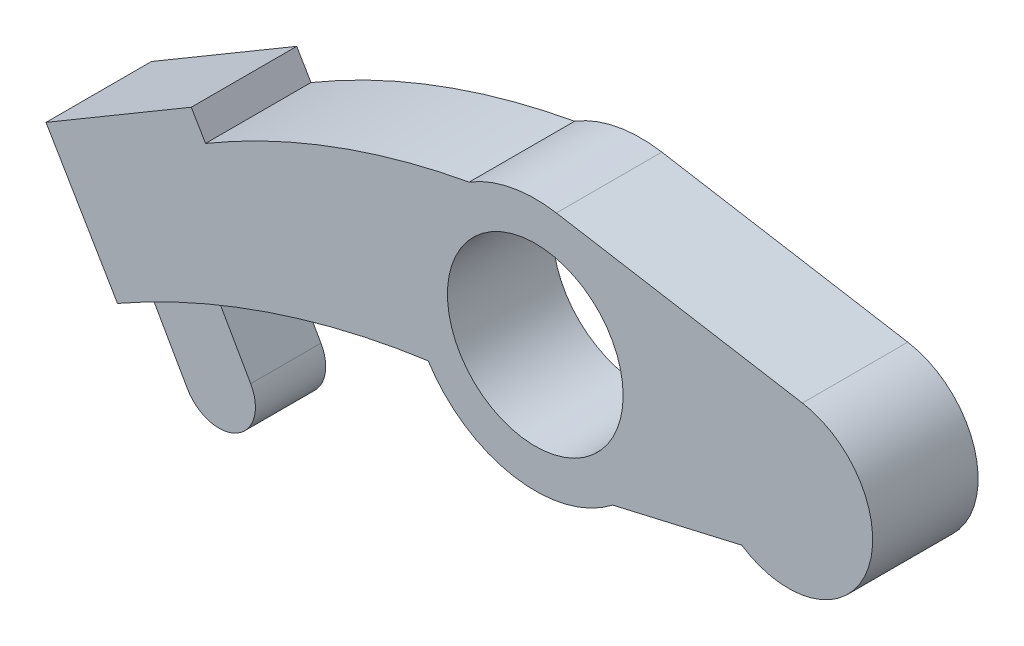
ISO-10303-21;
HEADER;
FILE_DESCRIPTION(('STEP AP214'),'2;1');
FILE_NAME('part.step','',(''),(''),'','','');
FILE_SCHEMA(('AUTOMOTIVE_DESIGN { 1 0 10303 214 1 1 1 1 }'));
ENDSEC;
DATA;
#1=APPLICATION_CONTEXT('core data for automotive mechanical design processes');
#2=APPLICATION_PROTOCOL_DEFINITION('international standard','automotive_design',2000,#1);
#3=PRODUCT_CONTEXT('',#1,'mechanical');
#4=PRODUCT('Part','Part','',(#3));
#5=PRODUCT_RELATED_PRODUCT_CATEGORY('part','',(#4));
#6=PRODUCT_DEFINITION_FORMATION('','',#4);
#7=PRODUCT_DEFINITION_CONTEXT('part definition',#1,'design');
#8=PRODUCT_DEFINITION('design','',#6,#7);
#9=PRODUCT_DEFINITION_SHAPE('','',#8);
#10=(LENGTH_UNIT() NAMED_UNIT(*) SI_UNIT(.MILLI.,.METRE.));
#11=(NAMED_UNIT(*) PLANE_ANGLE_UNIT() SI_UNIT($,.RADIAN.));
#12=(NAMED_UNIT(*) SI_UNIT($,.STERADIAN.) SOLID_ANGLE_UNIT());
#13=UNCERTAINTY_MEASURE_WITH_UNIT(LENGTH_MEASURE(1.E-05),#10,'distance_accuracy_value','');
#14=(GEOMETRIC_REPRESENTATION_CONTEXT(3) GLOBAL_UNCERTAINTY_ASSIGNED_CONTEXT((#13)) GLOBAL_UNIT_ASSIGNED_CONTEXT((#10,
#11,#12)) REPRESENTATION_CONTEXT('',''));
#15=CARTESIAN_POINT('',(0.,0.,0.));
#16=DIRECTION('',(0.,0.,1.));
#17=DIRECTION('',(1.,0.,0.));
#18=AXIS2_PLACEMENT_3D('',#15,#16,#17);
#19=CARTESIAN_POINT('',(1.5,8.87411967464942,3.75));
#20=DIRECTION('',(-0.166666666666667,-0.986013297183269,0.));
#21=DIRECTION('',(0.986013297183269,-0.166666666666667,0.));
#22=AXIS2_PLACEMENT_3D('',#19,#20,#21);
#23=PLANE('',#22);
#24=DIRECTION('',(-0.986013297183269,0.166666666666667,0.));
#25=VECTOR('',#24,1.);
#26=CARTESIAN_POINT('',(1.5,8.87411967464942,-3.75));
#27=LINE('',#26,#25);
#28=CARTESIAN_POINT('',(19.,5.91607978309962,-3.75));
#29=VERTEX_POINT('',#28);
#30=CARTESIAN_POINT('',(1.5,8.87411967464943,-3.75));
#31=VERTEX_POINT('',#30);
#32=EDGE_CURVE('E155',#29,#31,#27,.T.);
#33=ORIENTED_EDGE('',*,*,#32,.T.);
#34=DIRECTION('',(0.,0.,-1.));
#35=VECTOR('',#34,1.);
#36=CARTESIAN_POINT('',(1.5,8.87411967464943,3.75));
#37=LINE('',#36,#35);
#38=CARTESIAN_POINT('',(1.5,8.87411967464943,3.75));
#39=VERTEX_POINT('',#38);
#40=EDGE_CURVE('E233',#39,#31,#37,.T.);
#41=ORIENTED_EDGE('',*,*,#40,.F.);
#42=DIRECTION('',(-0.986013297183269,0.166666666666667,0.));
#43=VECTOR('',#42,1.);
#44=CARTESIAN_POINT('',(1.5,8.87411967464942,3.75));
#45=LINE('',#44,#43);
#46=CARTESIAN_POINT('',(19.,5.91607978309962,3.75));
#47=VERTEX_POINT('',#46);
#48=EDGE_CURVE('E164',#47,#39,#45,.T.);
#49=ORIENTED_EDGE('',*,*,#48,.F.);
#50=DIRECTION('',(0.,0.,-1.));
#51=VECTOR('',#50,1.);
#52=CARTESIAN_POINT('',(19.,5.91607978309962,3.75));
#53=LINE('',#52,#51);
#54=EDGE_CURVE('E186',#47,#29,#53,.T.);
#55=ORIENTED_EDGE('',*,*,#54,.T.);
#56=EDGE_LOOP('',(#33,#41,#49,#55));
#57=FACE_BOUND('',#56,.T.);
#58=ADVANCED_FACE('F35',(#57),#23,.F.);
#59=CARTESIAN_POINT('',(0.,0.,3.75));
#60=DIRECTION('',(0.,0.,-1.));
#61=DIRECTION('',(-1.,0.,0.));
#62=AXIS2_PLACEMENT_3D('',#59,#60,#61);
#63=CYLINDRICAL_SURFACE('',#62,9.);
#64=CARTESIAN_POINT('',(0.,0.,-3.75));
#65=DIRECTION('',(0.,0.,1.));
#66=DIRECTION('',(1.,0.,0.));
#67=AXIS2_PLACEMENT_3D('',#64,#65,#66);
#68=CIRCLE('',#67,9.);
#69=CARTESIAN_POINT('',(-4.70447305648873,7.67254411918052,-3.75));
#70=VERTEX_POINT('',#69);
#71=EDGE_CURVE('E190',#31,#70,#68,.T.);
#72=ORIENTED_EDGE('',*,*,#71,.T.);
#73=DIRECTION('',(0.,0.,-1.));
#74=VECTOR('',#73,1.);
#75=CARTESIAN_POINT('',(-4.70447305648873,7.67254411918052,3.75));
#76=LINE('',#75,#74);
#77=CARTESIAN_POINT('',(-4.70447305648873,7.67254411918052,3.75));
#78=VERTEX_POINT('',#77);
#79=EDGE_CURVE('E230',#78,#70,#76,.T.);
#80=ORIENTED_EDGE('',*,*,#79,.F.);
#81=CARTESIAN_POINT('',(0.,0.,3.75));
#82=DIRECTION('',(0.,0.,1.));
#83=DIRECTION('',(1.,0.,0.));
#84=AXIS2_PLACEMENT_3D('',#81,#82,#83);
#85=CIRCLE('',#84,9.);
#86=EDGE_CURVE('E168',#39,#78,#85,.T.);
#87=ORIENTED_EDGE('',*,*,#86,.F.);
#88=ORIENTED_EDGE('',*,*,#40,.T.);
#89=EDGE_LOOP('',(#72,#80,#87,#88));
#90=FACE_BOUND('',#89,.T.);
#91=ADVANCED_FACE('F258',(#90),#63,.T.);
#92=CARTESIAN_POINT('',(5.52573889605432,-48.4018953644741,3.75));
#93=DIRECTION('',(0.,0.,-1.));
#94=DIRECTION('',(-1.,0.,0.));
#95=AXIS2_PLACEMENT_3D('',#92,#93,#94);
#96=CYLINDRICAL_SURFACE('',#95,57.);
#97=CARTESIAN_POINT('',(5.52573889605432,-48.4018953644741,-3.75));
#98=DIRECTION('',(0.,0.,1.));
#99=DIRECTION('',(1.,0.,0.));
#100=AXIS2_PLACEMENT_3D('',#97,#98,#99);
#101=CIRCLE('',#100,57.);
#102=CARTESIAN_POINT('',(-23.4539946072826,0.681452586491636,-3.75));
#103=VERTEX_POINT('',#102);
#104=EDGE_CURVE('E192',#70,#103,#101,.T.);
#105=ORIENTED_EDGE('',*,*,#104,.T.);
#106=DIRECTION('',(0.,0.,-1.));
#107=VECTOR('',#106,1.);
#108=CARTESIAN_POINT('',(-23.4539946072826,0.681452586491636,3.75));
#109=LINE('',#108,#107);
#110=CARTESIAN_POINT('',(-23.4539946072826,0.681452586491636,3.75));
#111=VERTEX_POINT('',#110);
#112=EDGE_CURVE('E227',#111,#103,#109,.T.);
#113=ORIENTED_EDGE('',*,*,#112,.F.);
#114=CARTESIAN_POINT('',(5.52573889605432,-48.4018953644741,3.75));
#115=DIRECTION('',(0.,0.,1.));
#116=DIRECTION('',(1.,0.,0.));
#117=AXIS2_PLACEMENT_3D('',#114,#115,#116);
#118=CIRCLE('',#117,57.);
#119=EDGE_CURVE('E170',#78,#111,#118,.T.);
#120=ORIENTED_EDGE('',*,*,#119,.F.);
#121=ORIENTED_EDGE('',*,*,#79,.T.);
#122=EDGE_LOOP('',(#105,#113,#120,#121));
#123=FACE_BOUND('',#122,.T.);
#124=ADVANCED_FACE('F263',(#123),#96,.T.);
#125=CARTESIAN_POINT('',(-17.093094845764,-10.0920852805795,3.75));
#126=DIRECTION('',(-0.861111367560802,-0.508416377251525,0.));
#127=DIRECTION('',(0.508416377251525,-0.861111367560802,0.));
#128=AXIS2_PLACEMENT_3D('',#125,#126,#127);
#129=PLANE('',#128);
#130=DIRECTION('',(-0.508416377251525,0.861111367560802,0.));
#131=VECTOR('',#130,1.);
#132=CARTESIAN_POINT('',(-17.093094845764,-10.0920852805795,-3.75));
#133=LINE('',#132,#131);
#134=CARTESIAN_POINT('',(-24.4708273617856,2.40367532161324,-3.75));
#135=VERTEX_POINT('',#134);
#136=EDGE_CURVE('E194',#103,#135,#133,.T.);
#137=ORIENTED_EDGE('',*,*,#136,.T.);
#138=DIRECTION('',(0.,0.,-1.));
#139=VECTOR('',#138,1.);
#140=CARTESIAN_POINT('',(-24.4708273617856,2.40367532161324,3.75));
#141=LINE('',#140,#139);
#142=CARTESIAN_POINT('',(-24.4708273617856,2.40367532161324,3.75));
#143=VERTEX_POINT('',#142);
#144=EDGE_CURVE('E224',#143,#135,#141,.T.);
#145=ORIENTED_EDGE('',*,*,#144,.F.);
#146=DIRECTION('',(-0.508416377251525,0.861111367560802,0.));
#147=VECTOR('',#146,1.);
#148=CARTESIAN_POINT('',(-17.093094845764,-10.0920852805795,3.75));
#149=LINE('',#148,#147);
#150=EDGE_CURVE('E172',#111,#143,#149,.T.);
#151=ORIENTED_EDGE('',*,*,#150,.F.);
#152=ORIENTED_EDGE('',*,*,#112,.T.);
#153=EDGE_LOOP('',(#137,#145,#151,#152));
#154=FACE_BOUND('',#153,.T.);
#155=ADVANCED_FACE('F269',(#154),#129,.F.);
#156=CARTESIAN_POINT('',(-7.37773251602158,12.4957606021927,3.75));
#157=DIRECTION('',(0.508416377251524,-0.861111367560803,0.));
#158=DIRECTION('',(0.861111367560803,0.508416377251524,0.));
#159=AXIS2_PLACEMENT_3D('',#156,#157,#158);
#160=PLANE('',#159);
#161=DIRECTION('',(-0.861111367560803,-0.508416377251524,0.));
#162=VECTOR('',#161,1.);
#163=CARTESIAN_POINT('',(-7.37773251602158,12.4957606021927,-3.75));
#164=LINE('',#163,#162);
#165=CARTESIAN_POINT('',(-34.8041637725152,-3.69732120540505,-3.75));
#166=VERTEX_POINT('',#165);
#167=EDGE_CURVE('E196',#135,#166,#164,.T.);
#168=ORIENTED_EDGE('',*,*,#167,.T.);
#169=DIRECTION('',(0.,0.,-1.));
#170=VECTOR('',#169,1.);
#171=CARTESIAN_POINT('',(-34.8041637725152,-3.69732120540505,3.75));
#172=LINE('',#171,#170);
#173=CARTESIAN_POINT('',(-34.8041637725152,-3.69732120540505,3.75));
#174=VERTEX_POINT('',#173);
#175=EDGE_CURVE('E221',#174,#166,#172,.T.);
#176=ORIENTED_EDGE('',*,*,#175,.F.);
#177=DIRECTION('',(-0.861111367560803,-0.508416377251524,0.));
#178=VECTOR('',#177,1.);
#179=CARTESIAN_POINT('',(-7.37773251602158,12.4957606021927,3.75));
#180=LINE('',#179,#178);
#181=EDGE_CURVE('E174',#143,#174,#180,.T.);
#182=ORIENTED_EDGE('',*,*,#181,.F.);
#183=ORIENTED_EDGE('',*,*,#144,.T.);
#184=EDGE_LOOP('',(#168,#176,#182,#183));
#185=FACE_BOUND('',#184,.T.);
#186=ADVANCED_FACE('F273',(#185),#160,.F.);
#187=CARTESIAN_POINT('',(-27.4264312564937,-16.1930818075978,3.75));
#188=DIRECTION('',(0.861111367560802,0.508416377251524,0.));
#189=DIRECTION('',(-0.508416377251525,0.861111367560803,0.));
#190=AXIS2_PLACEMENT_3D('',#187,#188,#189);
#191=PLANE('',#190);
#192=DIRECTION('',(0.508416377251525,-0.861111367560803,0.));
#193=VECTOR('',#192,1.);
#194=CARTESIAN_POINT('',(-27.4264312564937,-16.1930818075978,-3.75));
#195=LINE('',#194,#193);
#196=CARTESIAN_POINT('',(-29.72,-12.3084348810131,-3.75));
#197=VERTEX_POINT('',#196);
#198=EDGE_CURVE('E198',#166,#197,#195,.T.);
#199=ORIENTED_EDGE('',*,*,#198,.T.);
#200=DIRECTION('',(0.,0.,-1.));
#201=VECTOR('',#200,1.);
#202=CARTESIAN_POINT('',(-29.72,-12.3084348810131,3.75));
#203=LINE('',#202,#201);
#204=CARTESIAN_POINT('',(-29.72,-12.3084348810131,3.75));
#205=VERTEX_POINT('',#204);
#206=EDGE_CURVE('E218',#205,#197,#203,.T.);
#207=ORIENTED_EDGE('',*,*,#206,.F.);
#208=DIRECTION('',(0.508416377251525,-0.861111367560803,0.));
#209=VECTOR('',#208,1.);
#210=CARTESIAN_POINT('',(-27.4264312564937,-16.1930818075978,3.75));
#211=LINE('',#210,#209);
#212=EDGE_CURVE('E176',#174,#205,#211,.T.);
#213=ORIENTED_EDGE('',*,*,#212,.F.);
#214=ORIENTED_EDGE('',*,*,#175,.T.);
#215=EDGE_LOOP('',(#199,#207,#213,#214));
#216=FACE_BOUND('',#215,.T.);
#217=ADVANCED_FACE('F277',(#216),#191,.F.);
#218=CARTESIAN_POINT('',(0.933629543152334,-66.2005029043426,3.75));
#219=DIRECTION('',(0.,0.,-1.));
#220=DIRECTION('',(-1.,0.,0.));
#221=AXIS2_PLACEMENT_3D('',#218,#219,#220);
#222=CYLINDRICAL_SURFACE('',#221,62.);
#223=DIRECTION('',(0.,0.,-1.));
#224=VECTOR('',#223,1.);
#225=CARTESIAN_POINT('',(-28.627235729974,-11.7013722295871,3.75));
#226=LINE('',#225,#224);
#227=CARTESIAN_POINT('',(-28.627235729974,-11.7013722295871,2.5));
#228=VERTEX_POINT('',#227);
#229=CARTESIAN_POINT('',(-28.627235729974,-11.7013722295871,-2.5));
#230=VERTEX_POINT('',#229);
#231=EDGE_CURVE('E43',#228,#230,#226,.T.);
#232=ORIENTED_EDGE('',*,*,#231,.F.);
#233=CARTESIAN_POINT('',(0.933629543152334,-66.2005029043426,2.5));
#234=DIRECTION('',(0.,0.,1.));
#235=DIRECTION('',(1.,0.,0.));
#236=AXIS2_PLACEMENT_3D('',#233,#234,#235);
#237=CIRCLE('',#236,62.);
#238=CARTESIAN_POINT('',(-23.9686846659175,-9.42132761064221,2.5));
#239=VERTEX_POINT('',#238);
#240=EDGE_CURVE('E11',#228,#239,#237,.F.);
#241=ORIENTED_EDGE('',*,*,#240,.T.);
#242=DIRECTION('',(0.,0.,-1.));
#243=VECTOR('',#242,1.);
#244=CARTESIAN_POINT('',(-23.9686846659175,-9.4213276106422,2.5));
#245=LINE('',#244,#243);
#246=CARTESIAN_POINT('',(-23.9686846659175,-9.4213276106422,-2.5));
#247=VERTEX_POINT('',#246);
#248=EDGE_CURVE('E157',#239,#247,#245,.T.);
#249=ORIENTED_EDGE('',*,*,#248,.T.);
#250=CARTESIAN_POINT('',(0.933629543152334,-66.2005029043426,-2.5));
#251=DIRECTION('',(0.,0.,1.));
#252=DIRECTION('',(1.,0.,0.));
#253=AXIS2_PLACEMENT_3D('',#250,#251,#252);
#254=CIRCLE('',#253,62.);
#255=EDGE_CURVE('E236',#230,#247,#254,.F.);
#256=ORIENTED_EDGE('',*,*,#255,.F.);
#257=EDGE_LOOP('',(#232,#241,#249,#256));
#258=FACE_BOUND('',#257,.T.);
#259=CARTESIAN_POINT('',(0.933629543152334,-66.2005029043426,-3.75));
#260=DIRECTION('',(0.,0.,1.));
#261=DIRECTION('',(1.,0.,0.));
#262=AXIS2_PLACEMENT_3D('',#259,#260,#261);
#263=CIRCLE('',#262,62.);
#264=CARTESIAN_POINT('',(-7.61753576880317,-4.79303127582164,-3.75));
#265=VERTEX_POINT('',#264);
#266=EDGE_CURVE('E200',#197,#265,#263,.F.);
#267=ORIENTED_EDGE('',*,*,#266,.T.);
#268=DIRECTION('',(0.,0.,-1.));
#269=VECTOR('',#268,1.);
#270=CARTESIAN_POINT('',(-7.61753576880317,-4.79303127582164,3.75));
#271=LINE('',#270,#269);
#272=CARTESIAN_POINT('',(-7.61753576880317,-4.79303127582164,3.75));
#273=VERTEX_POINT('',#272);
#274=EDGE_CURVE('E215',#273,#265,#271,.T.);
#275=ORIENTED_EDGE('',*,*,#274,.F.);
#276=CARTESIAN_POINT('',(0.933629543152334,-66.2005029043426,3.75));
#277=DIRECTION('',(0.,0.,1.));
#278=DIRECTION('',(1.,0.,0.));
#279=AXIS2_PLACEMENT_3D('',#276,#277,#278);
#280=CIRCLE('',#279,62.);
#281=EDGE_CURVE('E178',#205,#273,#280,.F.);
#282=ORIENTED_EDGE('',*,*,#281,.F.);
#283=ORIENTED_EDGE('',*,*,#206,.T.);
#284=EDGE_LOOP('',(#267,#275,#282,#283));
#285=FACE_BOUND('',#284,.T.);
#286=ADVANCED_FACE('F281',(#258,#285),#222,.F.);
#287=CARTESIAN_POINT('',(0.,0.,3.75));
#288=DIRECTION('',(0.,0.,-1.));
#289=DIRECTION('',(-1.,0.,0.));
#290=AXIS2_PLACEMENT_3D('',#287,#288,#289);
#291=CYLINDRICAL_SURFACE('',#290,9.);
#292=CARTESIAN_POINT('',(0.,0.,-3.75));
#293=DIRECTION('',(0.,0.,1.));
#294=DIRECTION('',(1.,0.,0.));
#295=AXIS2_PLACEMENT_3D('',#292,#293,#294);
#296=CIRCLE('',#295,9.);
#297=CARTESIAN_POINT('',(5.50692711993437,-7.11854997142896,-3.75));
#298=VERTEX_POINT('',#297);
#299=EDGE_CURVE('E202',#265,#298,#296,.T.);
#300=ORIENTED_EDGE('',*,*,#299,.T.);
#301=DIRECTION('',(0.,0.,-1.));
#302=VECTOR('',#301,1.);
#303=CARTESIAN_POINT('',(5.50692711993437,-7.11854997142896,3.75));
#304=LINE('',#303,#302);
#305=CARTESIAN_POINT('',(5.50692711993437,-7.11854997142896,3.75));
#306=VERTEX_POINT('',#305);
#307=EDGE_CURVE('E213',#306,#298,#304,.T.);
#308=ORIENTED_EDGE('',*,*,#307,.F.);
#309=CARTESIAN_POINT('',(0.,0.,3.75));
#310=DIRECTION('',(0.,0.,1.));
#311=DIRECTION('',(1.,0.,0.));
#312=AXIS2_PLACEMENT_3D('',#309,#310,#311);
#313=CIRCLE('',#312,9.);
#314=EDGE_CURVE('E180',#273,#306,#313,.T.);
#315=ORIENTED_EDGE('',*,*,#314,.F.);
#316=ORIENTED_EDGE('',*,*,#274,.T.);
#317=EDGE_LOOP('',(#300,#308,#315,#316));
#318=FACE_BOUND('',#317,.T.);
#319=ADVANCED_FACE('F285',(#318),#291,.T.);
#320=CARTESIAN_POINT('',(1.83895036279225,-7.96536913044095,3.75));
#321=DIRECTION('',(0.224951054343859,-0.974370064785237,0.));
#322=DIRECTION('',(0.974370064785237,0.224951054343859,0.));
#323=AXIS2_PLACEMENT_3D('',#320,#321,#322);
#324=PLANE('',#323);
#325=DIRECTION('',(-0.974370064785237,-0.224951054343859,0.));
#326=VECTOR('',#325,1.);
#327=CARTESIAN_POINT('',(1.83895036279225,-7.96536913044095,-3.75));
#328=LINE('',#327,#326);
#329=CARTESIAN_POINT('',(14.6833752096446,-5.,-3.75));
#330=VERTEX_POINT('',#329);
#331=EDGE_CURVE('E205',#330,#298,#328,.T.);
#332=ORIENTED_EDGE('',*,*,#331,.F.);
#333=DIRECTION('',(0.,0.,-1.));
#334=VECTOR('',#333,1.);
#335=CARTESIAN_POINT('',(14.6833752096446,-5.,3.75));
#336=LINE('',#335,#334);
#337=CARTESIAN_POINT('',(14.6833752096446,-5.,3.75));
#338=VERTEX_POINT('',#337);
#339=EDGE_CURVE('E211',#338,#330,#336,.T.);
#340=ORIENTED_EDGE('',*,*,#339,.F.);
#341=DIRECTION('',(-0.974370064785237,-0.224951054343859,0.));
#342=VECTOR('',#341,1.);
#343=CARTESIAN_POINT('',(1.83895036279225,-7.96536913044095,3.75));
#344=LINE('',#343,#342);
#345=EDGE_CURVE('E182',#338,#306,#344,.T.);
#346=ORIENTED_EDGE('',*,*,#345,.T.);
#347=ORIENTED_EDGE('',*,*,#307,.T.);
#348=EDGE_LOOP('',(#332,#340,#346,#347));
#349=FACE_BOUND('',#348,.T.);
#350=ADVANCED_FACE('F288',(#349),#324,.T.);
#351=CARTESIAN_POINT('',(0.,0.,3.75));
#352=DIRECTION('',(0.,0.,-1.));
#353=DIRECTION('',(-1.,0.,0.));
#354=AXIS2_PLACEMENT_3D('',#351,#352,#353);
#355=CYLINDRICAL_SURFACE('',#354,6.25);
#356=CARTESIAN_POINT('',(0.,0.,3.75));
#357=DIRECTION('',(0.,0.,1.));
#358=DIRECTION('',(1.,0.,0.));
#359=AXIS2_PLACEMENT_3D('',#356,#357,#358);
#360=CIRCLE('',#359,6.25);
#361=CARTESIAN_POINT('',(6.25,0.,3.75));
#362=VERTEX_POINT('',#361);
#363=EDGE_CURVE('E161',#362,#362,#360,.T.);
#364=ORIENTED_EDGE('',*,*,#363,.T.);
#365=EDGE_LOOP('',(#364));
#366=FACE_BOUND('',#365,.T.);
#367=CARTESIAN_POINT('',(0.,0.,-3.75));
#368=DIRECTION('',(0.,0.,1.));
#369=DIRECTION('',(1.,0.,0.));
#370=AXIS2_PLACEMENT_3D('',#367,#368,#369);
#371=CIRCLE('',#370,6.25);
#372=CARTESIAN_POINT('',(6.25,0.,-3.75));
#373=VERTEX_POINT('',#372);
#374=EDGE_CURVE('E152',#373,#373,#371,.T.);
#375=ORIENTED_EDGE('',*,*,#374,.F.);
#376=EDGE_LOOP('',(#375));
#377=FACE_BOUND('',#376,.T.);
#378=ADVANCED_FACE('F37',(#366,#377),#355,.F.);
#379=CARTESIAN_POINT('',(18.,0.,3.75));
#380=DIRECTION('',(0.,0.,-1.));
#381=DIRECTION('',(-1.,0.,0.));
#382=AXIS2_PLACEMENT_3D('',#379,#380,#381);
#383=CYLINDRICAL_SURFACE('',#382,6.);
#384=CARTESIAN_POINT('',(18.,0.,-3.75));
#385=DIRECTION('',(0.,0.,1.));
#386=DIRECTION('',(1.,0.,0.));
#387=AXIS2_PLACEMENT_3D('',#384,#385,#386);
#388=CIRCLE('',#387,6.);
#389=EDGE_CURVE('E165',#330,#29,#388,.T.);
#390=ORIENTED_EDGE('',*,*,#389,.T.);
#391=ORIENTED_EDGE('',*,*,#54,.F.);
#392=CARTESIAN_POINT('',(18.,0.,3.75));
#393=DIRECTION('',(0.,0.,1.));
#394=DIRECTION('',(1.,0.,0.));
#395=AXIS2_PLACEMENT_3D('',#392,#393,#394);
#396=CIRCLE('',#395,6.);
#397=EDGE_CURVE('E185',#338,#47,#396,.T.);
#398=ORIENTED_EDGE('',*,*,#397,.F.);
#399=ORIENTED_EDGE('',*,*,#339,.T.);
#400=EDGE_LOOP('',(#390,#391,#398,#399));
#401=FACE_BOUND('',#400,.T.);
#402=ADVANCED_FACE('F293',(#401),#383,.T.);
#403=CARTESIAN_POINT('',(0.,0.,3.75));
#404=DIRECTION('',(0.,0.,1.));
#405=DIRECTION('',(1.,0.,0.));
#406=AXIS2_PLACEMENT_3D('',#403,#404,#405);
#407=PLANE('',#406);
#408=ORIENTED_EDGE('',*,*,#363,.F.);
#409=EDGE_LOOP('',(#408));
#410=FACE_BOUND('',#409,.T.);
#411=ORIENTED_EDGE('',*,*,#48,.T.);
#412=ORIENTED_EDGE('',*,*,#86,.T.);
#413=ORIENTED_EDGE('',*,*,#119,.T.);
#414=ORIENTED_EDGE('',*,*,#150,.T.);
#415=ORIENTED_EDGE('',*,*,#181,.T.);
#416=ORIENTED_EDGE('',*,*,#212,.T.);
#417=ORIENTED_EDGE('',*,*,#281,.T.);
#418=ORIENTED_EDGE('',*,*,#314,.T.);
#419=ORIENTED_EDGE('',*,*,#345,.F.);
#420=ORIENTED_EDGE('',*,*,#397,.T.);
#421=EDGE_LOOP('',(#411,#412,#413,#414,#415,#416,#417,#418,#419,#420));
#422=FACE_BOUND('',#421,.T.);
#423=ADVANCED_FACE('F296',(#410,#422),#407,.T.);
#424=CARTESIAN_POINT('',(0.,0.,-3.75));
#425=DIRECTION('',(0.,0.,1.));
#426=DIRECTION('',(1.,0.,0.));
#427=AXIS2_PLACEMENT_3D('',#424,#425,#426);
#428=PLANE('',#427);
#429=ORIENTED_EDGE('',*,*,#374,.T.);
#430=EDGE_LOOP('',(#429));
#431=FACE_BOUND('',#430,.T.);
#432=ORIENTED_EDGE('',*,*,#32,.F.);
#433=ORIENTED_EDGE('',*,*,#389,.F.);
#434=ORIENTED_EDGE('',*,*,#331,.T.);
#435=ORIENTED_EDGE('',*,*,#299,.F.);
#436=ORIENTED_EDGE('',*,*,#266,.F.);
#437=ORIENTED_EDGE('',*,*,#198,.F.);
#438=ORIENTED_EDGE('',*,*,#167,.F.);
#439=ORIENTED_EDGE('',*,*,#136,.F.);
#440=ORIENTED_EDGE('',*,*,#104,.F.);
#441=ORIENTED_EDGE('',*,*,#71,.F.);
#442=EDGE_LOOP('',(#432,#433,#434,#435,#436,#437,#438,#439,#440,#441));
#443=FACE_BOUND('',#442,.T.);
#444=ADVANCED_FACE('F298',(#431,#443),#428,.F.);
#445=CARTESIAN_POINT('',(-28.6334663704974,-11.6904181563527,2.5));
#446=DIRECTION('',(0.86922690360209,0.494413379728263,0.));
#447=DIRECTION('',(-0.494413379728263,0.86922690360209,0.));
#448=AXIS2_PLACEMENT_3D('',#445,#446,#447);
#449=PLANE('',#448);
#450=DIRECTION('',(0.494413379728263,-0.86922690360209,0.));
#451=VECTOR('',#450,1.);
#452=CARTESIAN_POINT('',(-28.6334663704974,-11.6904181563527,2.5));
#453=LINE('',#452,#451);
#454=CARTESIAN_POINT('',(-25.9962772990008,-16.3268535458848,2.5));
#455=VERTEX_POINT('',#454);
#456=EDGE_CURVE('E130',#228,#455,#453,.T.);
#457=ORIENTED_EDGE('',*,*,#456,.F.);
#458=ORIENTED_EDGE('',*,*,#231,.T.);
#459=DIRECTION('',(0.494413379728263,-0.86922690360209,0.));
#460=VECTOR('',#459,1.);
#461=CARTESIAN_POINT('',(-28.6334663704974,-11.6904181563527,-2.5));
#462=LINE('',#461,#460);
#463=CARTESIAN_POINT('',(-25.9962772990008,-16.3268535458848,-2.5));
#464=VERTEX_POINT('',#463);
#465=EDGE_CURVE('E150',#230,#464,#462,.T.);
#466=ORIENTED_EDGE('',*,*,#465,.T.);
#467=DIRECTION('',(0.,0.,-1.));
#468=VECTOR('',#467,1.);
#469=CARTESIAN_POINT('',(-25.9962772990008,-16.3268535458848,2.5));
#470=LINE('',#469,#468);
#471=EDGE_CURVE('E142',#455,#464,#470,.T.);
#472=ORIENTED_EDGE('',*,*,#471,.F.);
#473=EDGE_LOOP('',(#457,#458,#466,#472));
#474=FACE_BOUND('',#473,.T.);
#475=ADVANCED_FACE('F148',(#474),#449,.F.);
#476=CARTESIAN_POINT('',(-23.7464475331385,-15.0471578372687,2.5));
#477=DIRECTION('',(0.,0.,1.));
#478=DIRECTION('',(1.,0.,0.));
#479=AXIS2_PLACEMENT_3D('',#476,#477,#478);
#480=PLANE('',#479);
#481=ORIENTED_EDGE('',*,*,#240,.F.);
#482=ORIENTED_EDGE('',*,*,#456,.T.);
#483=CARTESIAN_POINT('',(-23.7464475331385,-15.0471578372687,2.5));
#484=DIRECTION('',(0.,0.,1.));
#485=DIRECTION('',(1.,0.,0.));
#486=AXIS2_PLACEMENT_3D('',#483,#484,#485);
#487=CIRCLE('',#486,2.58831124133293);
#488=CARTESIAN_POINT('',(-21.4966177672762,-13.7674621286527,2.5));
#489=VERTEX_POINT('',#488);
#490=EDGE_CURVE('E133',#455,#489,#487,.T.);
#491=ORIENTED_EDGE('',*,*,#490,.T.);
#492=DIRECTION('',(-0.494413379728263,0.86922690360209,0.));
#493=VECTOR('',#492,1.);
#494=CARTESIAN_POINT('',(-21.4966177672762,-13.7674621286527,2.5));
#495=LINE('',#494,#493);
#496=EDGE_CURVE('E146',#489,#239,#495,.T.);
#497=ORIENTED_EDGE('',*,*,#496,.T.);
#498=EDGE_LOOP('',(#481,#482,#491,#497));
#499=FACE_BOUND('',#498,.T.);
#500=ADVANCED_FACE('F132',(#499),#480,.T.);
#501=CARTESIAN_POINT('',(-23.7464475331385,-15.0471578372687,-2.5));
#502=DIRECTION('',(0.,0.,1.));
#503=DIRECTION('',(1.,0.,0.));
#504=AXIS2_PLACEMENT_3D('',#501,#502,#503);
#505=PLANE('',#504);
#506=ORIENTED_EDGE('',*,*,#465,.F.);
#507=ORIENTED_EDGE('',*,*,#255,.T.);
#508=DIRECTION('',(-0.494413379728263,0.86922690360209,0.));
#509=VECTOR('',#508,1.);
#510=CARTESIAN_POINT('',(-21.4966177672762,-13.7674621286527,-2.5));
#511=LINE('',#510,#509);
#512=CARTESIAN_POINT('',(-21.4966177672762,-13.7674621286527,-2.5));
#513=VERTEX_POINT('',#512);
#514=EDGE_CURVE('E137',#513,#247,#511,.T.);
#515=ORIENTED_EDGE('',*,*,#514,.F.);
#516=CARTESIAN_POINT('',(-23.7464475331385,-15.0471578372687,-2.5));
#517=DIRECTION('',(0.,0.,1.));
#518=DIRECTION('',(1.,0.,0.));
#519=AXIS2_PLACEMENT_3D('',#516,#517,#518);
#520=CIRCLE('',#519,2.58831124133293);
#521=EDGE_CURVE('E242',#464,#513,#520,.T.);
#522=ORIENTED_EDGE('',*,*,#521,.F.);
#523=EDGE_LOOP('',(#506,#507,#515,#522));
#524=FACE_BOUND('',#523,.T.);
#525=ADVANCED_FACE('F239',(#524),#505,.F.);
#526=CARTESIAN_POINT('',(-23.7464475331385,-15.0471578372687,2.5));
#527=DIRECTION('',(0.,0.,-1.));
#528=DIRECTION('',(-1.,0.,0.));
#529=AXIS2_PLACEMENT_3D('',#526,#527,#528);
#530=CYLINDRICAL_SURFACE('',#529,2.58831124133293);
#531=ORIENTED_EDGE('',*,*,#521,.T.);
#532=DIRECTION('',(0.,0.,-1.));
#533=VECTOR('',#532,1.);
#534=CARTESIAN_POINT('',(-21.4966177672762,-13.7674621286527,2.5));
#535=LINE('',#534,#533);
#536=EDGE_CURVE('E144',#489,#513,#535,.T.);
#537=ORIENTED_EDGE('',*,*,#536,.F.);
#538=ORIENTED_EDGE('',*,*,#490,.F.);
#539=ORIENTED_EDGE('',*,*,#471,.T.);
#540=EDGE_LOOP('',(#531,#537,#538,#539));
#541=FACE_BOUND('',#540,.T.);
#542=ADVANCED_FACE('F141',(#541),#530,.T.);
#543=CARTESIAN_POINT('',(-21.4966177672762,-13.7674621286527,2.5));
#544=DIRECTION('',(-0.86922690360209,-0.494413379728263,0.));
#545=DIRECTION('',(0.494413379728263,-0.86922690360209,0.));
#546=AXIS2_PLACEMENT_3D('',#543,#544,#545);
#547=PLANE('',#546);
#548=ORIENTED_EDGE('',*,*,#514,.T.);
#549=ORIENTED_EDGE('',*,*,#248,.F.);
#550=ORIENTED_EDGE('',*,*,#496,.F.);
#551=ORIENTED_EDGE('',*,*,#536,.T.);
#552=EDGE_LOOP('',(#548,#549,#550,#551));
#553=FACE_BOUND('',#552,.T.);
#554=ADVANCED_FACE('F249',(#553),#547,.F.);
#555=CLOSED_SHELL('',(#58,#91,#124,#155,#186,#217,#286,#319,#350,#378,#402,#423,#444,#475,#500,
#525,#542,#554));
#556=MANIFOLD_SOLID_BREP('B2',#555);
#557=ADVANCED_BREP_SHAPE_REPRESENTATION('',(#18,#556),#14);
#558=SHAPE_DEFINITION_REPRESENTATION(#9,#557);
ENDSEC;
END-ISO-10303-21;
